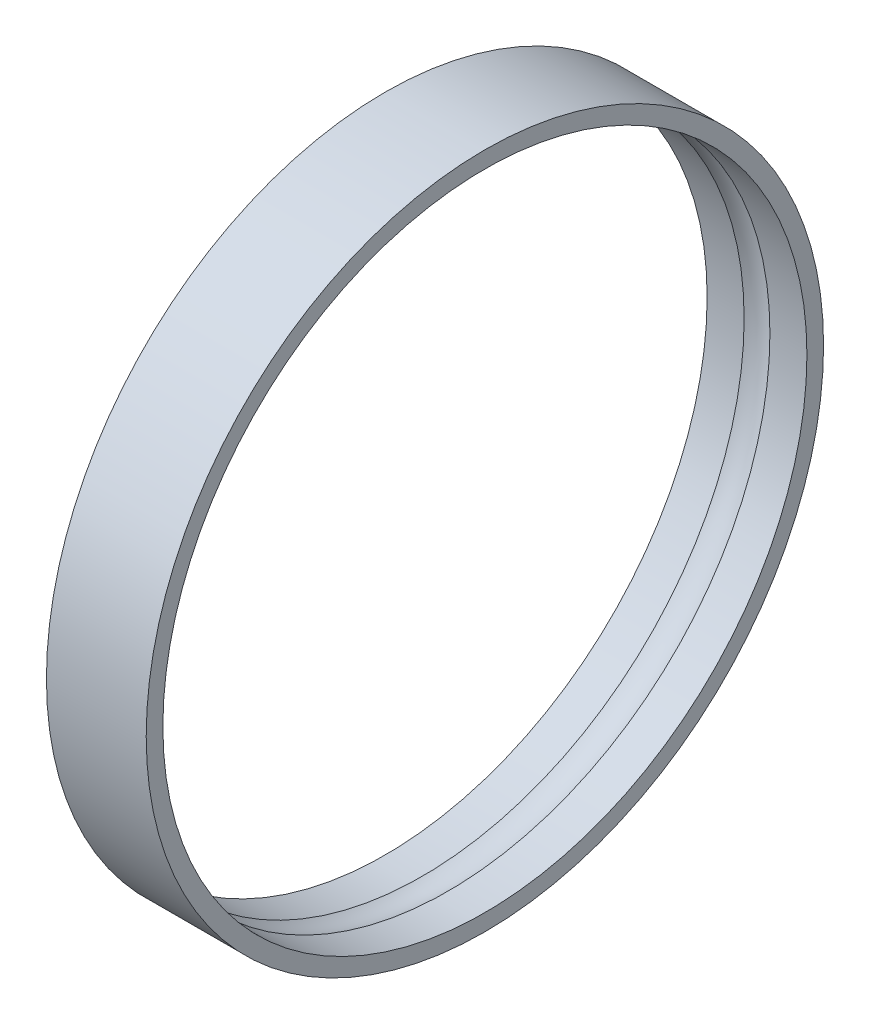
ISO-10303-21;
HEADER;
FILE_DESCRIPTION(('STEP AP214'),'2;1');
FILE_NAME('part.step','',(''),(''),'','','');
FILE_SCHEMA(('AUTOMOTIVE_DESIGN { 1 0 10303 214 1 1 1 1 }'));
ENDSEC;
DATA;
#1=APPLICATION_CONTEXT('core data for automotive mechanical design processes');
#2=APPLICATION_PROTOCOL_DEFINITION('international standard','automotive_design',2000,#1);
#3=PRODUCT_CONTEXT('',#1,'mechanical');
#4=PRODUCT('Part','Part','',(#3));
#5=PRODUCT_RELATED_PRODUCT_CATEGORY('part','',(#4));
#6=PRODUCT_DEFINITION_FORMATION('','',#4);
#7=PRODUCT_DEFINITION_CONTEXT('part definition',#1,'design');
#8=PRODUCT_DEFINITION('design','',#6,#7);
#9=PRODUCT_DEFINITION_SHAPE('','',#8);
#10=(LENGTH_UNIT() NAMED_UNIT(*) SI_UNIT(.MILLI.,.METRE.));
#11=(NAMED_UNIT(*) PLANE_ANGLE_UNIT() SI_UNIT($,.RADIAN.));
#12=(NAMED_UNIT(*) SI_UNIT($,.STERADIAN.) SOLID_ANGLE_UNIT());
#13=UNCERTAINTY_MEASURE_WITH_UNIT(LENGTH_MEASURE(1.E-05),#10,'distance_accuracy_value','');
#14=(GEOMETRIC_REPRESENTATION_CONTEXT(3) GLOBAL_UNCERTAINTY_ASSIGNED_CONTEXT((#13)) GLOBAL_UNIT_ASSIGNED_CONTEXT((#10,
#11,#12)) REPRESENTATION_CONTEXT('',''));
#15=CARTESIAN_POINT('',(0.,0.,0.));
#16=DIRECTION('',(0.,0.,1.));
#17=DIRECTION('',(1.,0.,0.));
#18=AXIS2_PLACEMENT_3D('',#15,#16,#17);
#19=CARTESIAN_POINT('',(57.535,0.,0.));
#20=DIRECTION('',(1.,0.,0.));
#21=DIRECTION('',(0.,0.,-1.));
#22=AXIS2_PLACEMENT_3D('',#19,#20,#21);
#23=TOROIDAL_SURFACE('',#22,61.5315,6.75);
#24=CARTESIAN_POINT('',(54.8236243805035,0.,0.));
#25=DIRECTION('',(-1.,0.,0.));
#26=DIRECTION('',(0.,0.,1.));
#27=AXIS2_PLACEMENT_3D('',#24,#25,#26);
#28=CIRCLE('',#27,67.713);
#29=CARTESIAN_POINT('',(54.8236243805035,0.,67.713));
#30=VERTEX_POINT('',#29);
#31=EDGE_CURVE('E31',#30,#30,#28,.T.);
#32=ORIENTED_EDGE('',*,*,#31,.T.);
#33=EDGE_LOOP('',(#32));
#34=FACE_BOUND('',#33,.T.);
#35=CARTESIAN_POINT('',(60.2463756194965,0.,0.));
#36=DIRECTION('',(-1.,0.,0.));
#37=DIRECTION('',(0.,0.,1.));
#38=AXIS2_PLACEMENT_3D('',#35,#36,#37);
#39=CIRCLE('',#38,67.713);
#40=CARTESIAN_POINT('',(60.2463756194965,0.,67.713));
#41=VERTEX_POINT('',#40);
#42=EDGE_CURVE('E36',#41,#41,#39,.F.);
#43=ORIENTED_EDGE('',*,*,#42,.T.);
#44=EDGE_LOOP('',(#43));
#45=FACE_BOUND('',#44,.T.);
#46=ADVANCED_FACE('F15',(#34,#45),#23,.F.);
#47=CARTESIAN_POINT('',(57.535,0.,0.));
#48=DIRECTION('',(-1.,0.,0.));
#49=DIRECTION('',(0.,0.,1.));
#50=AXIS2_PLACEMENT_3D('',#47,#48,#49);
#51=CYLINDRICAL_SURFACE('',#50,67.713);
#52=CARTESIAN_POINT('',(47.045,0.,0.));
#53=DIRECTION('',(-1.,0.,0.));
#54=DIRECTION('',(0.,0.,1.));
#55=AXIS2_PLACEMENT_3D('',#52,#53,#54);
#56=CIRCLE('',#55,67.713);
#57=CARTESIAN_POINT('',(47.045,0.,67.713));
#58=VERTEX_POINT('',#57);
#59=EDGE_CURVE('E19',#58,#58,#56,.F.);
#60=ORIENTED_EDGE('',*,*,#59,.F.);
#61=EDGE_LOOP('',(#60));
#62=FACE_BOUND('',#61,.T.);
#63=ORIENTED_EDGE('',*,*,#31,.F.);
#64=EDGE_LOOP('',(#63));
#65=FACE_BOUND('',#64,.T.);
#66=ADVANCED_FACE('F48',(#62,#65),#51,.F.);
#67=CARTESIAN_POINT('',(57.535,0.,0.));
#68=DIRECTION('',(-1.,0.,0.));
#69=DIRECTION('',(0.,0.,1.));
#70=AXIS2_PLACEMENT_3D('',#67,#68,#69);
#71=CYLINDRICAL_SURFACE('',#70,67.713);
#72=ORIENTED_EDGE('',*,*,#42,.F.);
#73=EDGE_LOOP('',(#72));
#74=FACE_BOUND('',#73,.T.);
#75=CARTESIAN_POINT('',(68.025,0.,0.));
#76=DIRECTION('',(-1.,0.,0.));
#77=DIRECTION('',(0.,0.,1.));
#78=AXIS2_PLACEMENT_3D('',#75,#76,#77);
#79=CIRCLE('',#78,67.713);
#80=CARTESIAN_POINT('',(68.025,0.,67.713));
#81=VERTEX_POINT('',#80);
#82=EDGE_CURVE('E28',#81,#81,#79,.T.);
#83=ORIENTED_EDGE('',*,*,#82,.F.);
#84=EDGE_LOOP('',(#83));
#85=FACE_BOUND('',#84,.T.);
#86=ADVANCED_FACE('F50',(#74,#85),#71,.F.);
#87=CARTESIAN_POINT('',(47.045,0.,69.463));
#88=DIRECTION('',(-1.,0.,0.));
#89=DIRECTION('',(0.,0.,1.));
#90=AXIS2_PLACEMENT_3D('',#87,#88,#89);
#91=PLANE('',#90);
#92=ORIENTED_EDGE('',*,*,#59,.T.);
#93=EDGE_LOOP('',(#92));
#94=FACE_BOUND('',#93,.T.);
#95=CARTESIAN_POINT('',(47.045,0.,0.));
#96=DIRECTION('',(-1.,0.,0.));
#97=DIRECTION('',(0.,0.,1.));
#98=AXIS2_PLACEMENT_3D('',#95,#96,#97);
#99=CIRCLE('',#98,71.213);
#100=CARTESIAN_POINT('',(47.045,0.,71.213));
#101=VERTEX_POINT('',#100);
#102=EDGE_CURVE('E23',#101,#101,#99,.F.);
#103=ORIENTED_EDGE('',*,*,#102,.F.);
#104=EDGE_LOOP('',(#103));
#105=FACE_BOUND('',#104,.T.);
#106=ADVANCED_FACE('F57',(#94,#105),#91,.T.);
#107=CARTESIAN_POINT('',(68.025,0.,69.463));
#108=DIRECTION('',(1.,0.,0.));
#109=DIRECTION('',(0.,0.,-1.));
#110=AXIS2_PLACEMENT_3D('',#107,#108,#109);
#111=PLANE('',#110);
#112=CARTESIAN_POINT('',(68.025,0.,0.));
#113=DIRECTION('',(-1.,0.,0.));
#114=DIRECTION('',(0.,0.,1.));
#115=AXIS2_PLACEMENT_3D('',#112,#113,#114);
#116=CIRCLE('',#115,71.213);
#117=CARTESIAN_POINT('',(68.025,0.,71.213));
#118=VERTEX_POINT('',#117);
#119=EDGE_CURVE('E10',#118,#118,#116,.T.);
#120=ORIENTED_EDGE('',*,*,#119,.F.);
#121=EDGE_LOOP('',(#120));
#122=FACE_BOUND('',#121,.T.);
#123=ORIENTED_EDGE('',*,*,#82,.T.);
#124=EDGE_LOOP('',(#123));
#125=FACE_BOUND('',#124,.T.);
#126=ADVANCED_FACE('F62',(#122,#125),#111,.T.);
#127=CARTESIAN_POINT('',(57.535,0.,0.));
#128=DIRECTION('',(-1.,0.,0.));
#129=DIRECTION('',(0.,0.,1.));
#130=AXIS2_PLACEMENT_3D('',#127,#128,#129);
#131=CYLINDRICAL_SURFACE('',#130,71.213);
#132=ORIENTED_EDGE('',*,*,#102,.T.);
#133=EDGE_LOOP('',(#132));
#134=FACE_BOUND('',#133,.T.);
#135=ORIENTED_EDGE('',*,*,#119,.T.);
#136=EDGE_LOOP('',(#135));
#137=FACE_BOUND('',#136,.T.);
#138=ADVANCED_FACE('F60',(#134,#137),#131,.T.);
#139=CLOSED_SHELL('',(#46,#66,#86,#106,#126,#138));
#140=MANIFOLD_SOLID_BREP('B1',#139);
#141=ADVANCED_BREP_SHAPE_REPRESENTATION('',(#18,#140),#14);
#142=SHAPE_DEFINITION_REPRESENTATION(#9,#141);
ENDSEC;
END-ISO-10303-21;
